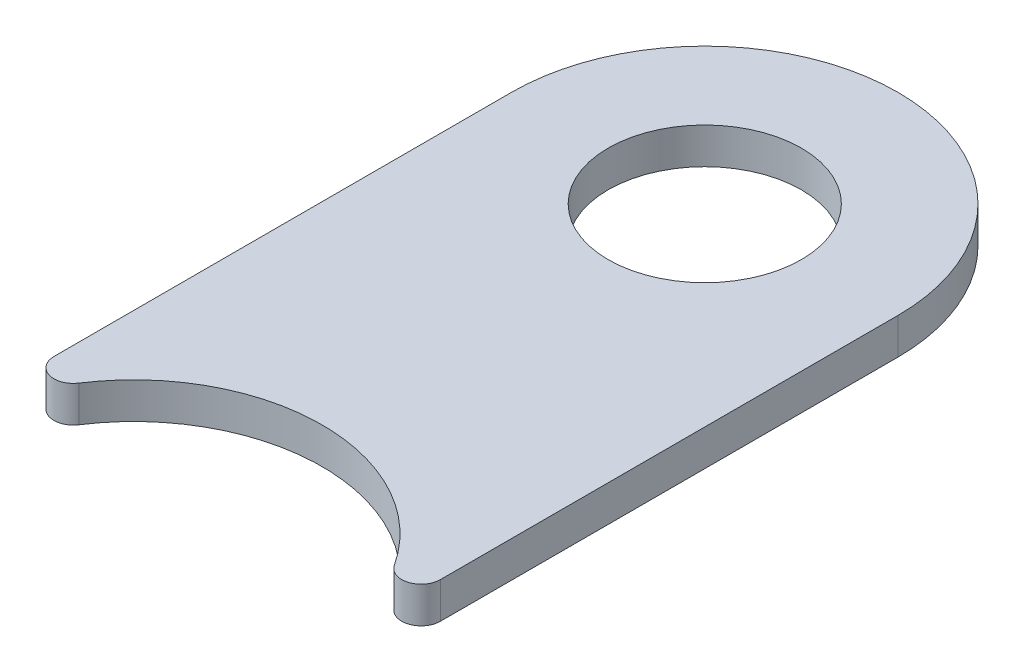
ISO-10303-21;
HEADER;
FILE_DESCRIPTION(('STEP AP214'),'2;1');
FILE_NAME('part.step','',(''),(''),'','','');
FILE_SCHEMA(('AUTOMOTIVE_DESIGN { 1 0 10303 214 1 1 1 1 }'));
ENDSEC;
DATA;
#1=APPLICATION_CONTEXT('core data for automotive mechanical design processes');
#2=APPLICATION_PROTOCOL_DEFINITION('international standard','automotive_design',2000,#1);
#3=PRODUCT_CONTEXT('',#1,'mechanical');
#4=PRODUCT('Part','Part','',(#3));
#5=PRODUCT_RELATED_PRODUCT_CATEGORY('part','',(#4));
#6=PRODUCT_DEFINITION_FORMATION('','',#4);
#7=PRODUCT_DEFINITION_CONTEXT('part definition',#1,'design');
#8=PRODUCT_DEFINITION('design','',#6,#7);
#9=PRODUCT_DEFINITION_SHAPE('','',#8);
#10=(LENGTH_UNIT() NAMED_UNIT(*) SI_UNIT(.MILLI.,.METRE.));
#11=(NAMED_UNIT(*) PLANE_ANGLE_UNIT() SI_UNIT($,.RADIAN.));
#12=(NAMED_UNIT(*) SI_UNIT($,.STERADIAN.) SOLID_ANGLE_UNIT());
#13=UNCERTAINTY_MEASURE_WITH_UNIT(LENGTH_MEASURE(1.E-05),#10,'distance_accuracy_value','');
#14=(GEOMETRIC_REPRESENTATION_CONTEXT(3) GLOBAL_UNCERTAINTY_ASSIGNED_CONTEXT((#13)) GLOBAL_UNIT_ASSIGNED_CONTEXT((#10,
#11,#12)) REPRESENTATION_CONTEXT('',''));
#15=CARTESIAN_POINT('',(0.,0.,0.));
#16=DIRECTION('',(0.,0.,1.));
#17=DIRECTION('',(1.,0.,0.));
#18=AXIS2_PLACEMENT_3D('',#15,#16,#17);
#19=CARTESIAN_POINT('',(22.86,-2.3749,-2.54));
#20=DIRECTION('',(0.,1.,0.));
#21=DIRECTION('',(0.,0.,1.));
#22=AXIS2_PLACEMENT_3D('',#19,#20,#21);
#23=CYLINDRICAL_SURFACE('',#22,2.54000000000001);
#24=CARTESIAN_POINT('',(22.86,2.3749,-2.54));
#25=DIRECTION('',(0.,1.,0.));
#26=DIRECTION('',(0.,0.,1.));
#27=AXIS2_PLACEMENT_3D('',#24,#25,#26);
#28=CIRCLE('',#27,2.54000000000001);
#29=CARTESIAN_POINT('',(20.7328946758003,2.3749,-1.15182748198889));
#30=VERTEX_POINT('',#29);
#31=CARTESIAN_POINT('',(25.4,2.3749,-2.54));
#32=VERTEX_POINT('',#31);
#33=EDGE_CURVE('E128',#30,#32,#28,.T.);
#34=ORIENTED_EDGE('',*,*,#33,.F.);
#35=DIRECTION('',(0.,1.,0.));
#36=VECTOR('',#35,1.);
#37=CARTESIAN_POINT('',(20.7328946758003,-2.3749,-1.15182748198889));
#38=LINE('',#37,#36);
#39=CARTESIAN_POINT('',(20.7328946758003,-2.3749,-1.15182748198889));
#40=VERTEX_POINT('',#39);
#41=EDGE_CURVE('E11',#40,#30,#38,.T.);
#42=ORIENTED_EDGE('',*,*,#41,.F.);
#43=CARTESIAN_POINT('',(22.86,-2.3749,-2.54));
#44=DIRECTION('',(0.,1.,0.));
#45=DIRECTION('',(0.,0.,1.));
#46=AXIS2_PLACEMENT_3D('',#43,#44,#45);
#47=CIRCLE('',#46,2.54000000000001);
#48=CARTESIAN_POINT('',(25.4,-2.3749,-2.54));
#49=VERTEX_POINT('',#48);
#50=EDGE_CURVE('E143',#40,#49,#47,.T.);
#51=ORIENTED_EDGE('',*,*,#50,.T.);
#52=DIRECTION('',(0.,1.,0.));
#53=VECTOR('',#52,1.);
#54=CARTESIAN_POINT('',(25.4,-2.3749,-2.54));
#55=LINE('',#54,#53);
#56=EDGE_CURVE('E46',#49,#32,#55,.T.);
#57=ORIENTED_EDGE('',*,*,#56,.T.);
#58=EDGE_LOOP('',(#34,#42,#51,#57));
#59=FACE_BOUND('',#58,.T.);
#60=ADVANCED_FACE('F43',(#59),#23,.T.);
#61=CARTESIAN_POINT('',(0.,-2.3749,12.3786894512019));
#62=DIRECTION('',(0.,1.,0.));
#63=DIRECTION('',(0.,0.,1.));
#64=AXIS2_PLACEMENT_3D('',#61,#62,#63);
#65=CYLINDRICAL_SURFACE('',#64,24.7573789024039);
#66=CARTESIAN_POINT('',(0.,2.3749,12.3786894512019));
#67=DIRECTION('',(0.,-1.,0.));
#68=DIRECTION('',(0.,0.,-1.));
#69=AXIS2_PLACEMENT_3D('',#66,#67,#68);
#70=CIRCLE('',#69,24.7573789024039);
#71=CARTESIAN_POINT('',(-20.7328946758003,2.3749,-1.15182748198889));
#72=VERTEX_POINT('',#71);
#73=EDGE_CURVE('E141',#72,#30,#70,.T.);
#74=ORIENTED_EDGE('',*,*,#73,.F.);
#75=DIRECTION('',(0.,1.,0.));
#76=VECTOR('',#75,1.);
#77=CARTESIAN_POINT('',(-20.7328946758003,-2.3749,-1.15182748198889));
#78=LINE('',#77,#76);
#79=CARTESIAN_POINT('',(-20.7328946758003,-2.3749,-1.15182748198889));
#80=VERTEX_POINT('',#79);
#81=EDGE_CURVE('E52',#80,#72,#78,.T.);
#82=ORIENTED_EDGE('',*,*,#81,.F.);
#83=CARTESIAN_POINT('',(0.,-2.3749,12.3786894512019));
#84=DIRECTION('',(0.,-1.,0.));
#85=DIRECTION('',(0.,0.,-1.));
#86=AXIS2_PLACEMENT_3D('',#83,#84,#85);
#87=CIRCLE('',#86,24.7573789024039);
#88=EDGE_CURVE('E118',#80,#40,#87,.T.);
#89=ORIENTED_EDGE('',*,*,#88,.T.);
#90=ORIENTED_EDGE('',*,*,#41,.T.);
#91=EDGE_LOOP('',(#74,#82,#89,#90));
#92=FACE_BOUND('',#91,.T.);
#93=ADVANCED_FACE('F151',(#92),#65,.F.);
#94=CARTESIAN_POINT('',(-22.86,-2.3749,-2.54));
#95=DIRECTION('',(0.,1.,0.));
#96=DIRECTION('',(0.,0.,1.));
#97=AXIS2_PLACEMENT_3D('',#94,#95,#96);
#98=CYLINDRICAL_SURFACE('',#97,2.54000000000001);
#99=CARTESIAN_POINT('',(-22.86,2.3749,-2.54));
#100=DIRECTION('',(0.,1.,0.));
#101=DIRECTION('',(0.,0.,-1.));
#102=AXIS2_PLACEMENT_3D('',#99,#100,#101);
#103=CIRCLE('',#102,2.54000000000001);
#104=CARTESIAN_POINT('',(-25.4,2.3749,-2.54));
#105=VERTEX_POINT('',#104);
#106=EDGE_CURVE('E105',#105,#72,#103,.T.);
#107=ORIENTED_EDGE('',*,*,#106,.F.);
#108=DIRECTION('',(0.,1.,0.));
#109=VECTOR('',#108,1.);
#110=CARTESIAN_POINT('',(-25.4,-2.3749,-2.54));
#111=LINE('',#110,#109);
#112=CARTESIAN_POINT('',(-25.4,-2.3749,-2.54));
#113=VERTEX_POINT('',#112);
#114=EDGE_CURVE('E100',#113,#105,#111,.T.);
#115=ORIENTED_EDGE('',*,*,#114,.F.);
#116=CARTESIAN_POINT('',(-22.86,-2.3749,-2.54));
#117=DIRECTION('',(0.,1.,0.));
#118=DIRECTION('',(0.,0.,-1.));
#119=AXIS2_PLACEMENT_3D('',#116,#117,#118);
#120=CIRCLE('',#119,2.54000000000001);
#121=EDGE_CURVE('E103',#113,#80,#120,.T.);
#122=ORIENTED_EDGE('',*,*,#121,.T.);
#123=ORIENTED_EDGE('',*,*,#81,.T.);
#124=EDGE_LOOP('',(#107,#115,#122,#123));
#125=FACE_BOUND('',#124,.T.);
#126=ADVANCED_FACE('F102',(#125),#98,.T.);
#127=CARTESIAN_POINT('',(-25.4,-2.3749,-62.6872));
#128=DIRECTION('',(-1.,0.,0.));
#129=DIRECTION('',(0.,0.,1.));
#130=AXIS2_PLACEMENT_3D('',#127,#128,#129);
#131=PLANE('',#130);
#132=DIRECTION('',(0.,0.,1.));
#133=VECTOR('',#132,1.);
#134=CARTESIAN_POINT('',(-25.4,2.3749,-62.6872));
#135=LINE('',#134,#133);
#136=CARTESIAN_POINT('',(-25.4,2.3749,-62.6872));
#137=VERTEX_POINT('',#136);
#138=EDGE_CURVE('E138',#137,#105,#135,.T.);
#139=ORIENTED_EDGE('',*,*,#138,.F.);
#140=DIRECTION('',(0.,1.,0.));
#141=VECTOR('',#140,1.);
#142=CARTESIAN_POINT('',(-25.4,-2.3749,-62.6872));
#143=LINE('',#142,#141);
#144=CARTESIAN_POINT('',(-25.4,-2.3749,-62.6872));
#145=VERTEX_POINT('',#144);
#146=EDGE_CURVE('E110',#145,#137,#143,.T.);
#147=ORIENTED_EDGE('',*,*,#146,.F.);
#148=DIRECTION('',(0.,0.,1.));
#149=VECTOR('',#148,1.);
#150=CARTESIAN_POINT('',(-25.4,-2.3749,-62.6872));
#151=LINE('',#150,#149);
#152=EDGE_CURVE('E116',#145,#113,#151,.T.);
#153=ORIENTED_EDGE('',*,*,#152,.T.);
#154=ORIENTED_EDGE('',*,*,#114,.T.);
#155=EDGE_LOOP('',(#139,#147,#153,#154));
#156=FACE_BOUND('',#155,.T.);
#157=ADVANCED_FACE('F120',(#156),#131,.T.);
#158=CARTESIAN_POINT('',(0.,-2.3749,-62.6872));
#159=DIRECTION('',(0.,1.,0.));
#160=DIRECTION('',(0.,0.,1.));
#161=AXIS2_PLACEMENT_3D('',#158,#159,#160);
#162=CYLINDRICAL_SURFACE('',#161,25.4);
#163=CARTESIAN_POINT('',(0.,2.3749,-62.6872));
#164=DIRECTION('',(0.,1.,0.));
#165=DIRECTION('',(0.,0.,-1.));
#166=AXIS2_PLACEMENT_3D('',#163,#164,#165);
#167=CIRCLE('',#166,25.4);
#168=CARTESIAN_POINT('',(25.4,2.3749,-62.6872));
#169=VERTEX_POINT('',#168);
#170=EDGE_CURVE('E135',#169,#137,#167,.T.);
#171=ORIENTED_EDGE('',*,*,#170,.F.);
#172=DIRECTION('',(0.,1.,0.));
#173=VECTOR('',#172,1.);
#174=CARTESIAN_POINT('',(25.4,-2.3749,-62.6872));
#175=LINE('',#174,#173);
#176=CARTESIAN_POINT('',(25.4,-2.3749,-62.6872));
#177=VERTEX_POINT('',#176);
#178=EDGE_CURVE('E146',#177,#169,#175,.T.);
#179=ORIENTED_EDGE('',*,*,#178,.F.);
#180=CARTESIAN_POINT('',(0.,-2.3749,-62.6872));
#181=DIRECTION('',(0.,1.,0.));
#182=DIRECTION('',(0.,0.,-1.));
#183=AXIS2_PLACEMENT_3D('',#180,#181,#182);
#184=CIRCLE('',#183,25.4);
#185=EDGE_CURVE('E121',#177,#145,#184,.T.);
#186=ORIENTED_EDGE('',*,*,#185,.T.);
#187=ORIENTED_EDGE('',*,*,#146,.T.);
#188=EDGE_LOOP('',(#171,#179,#186,#187));
#189=FACE_BOUND('',#188,.T.);
#190=ADVANCED_FACE('F164',(#189),#162,.T.);
#191=CARTESIAN_POINT('',(25.4,-2.3749,-62.6872));
#192=DIRECTION('',(1.,0.,0.));
#193=DIRECTION('',(0.,0.,-1.));
#194=AXIS2_PLACEMENT_3D('',#191,#192,#193);
#195=PLANE('',#194);
#196=DIRECTION('',(0.,0.,-1.));
#197=VECTOR('',#196,1.);
#198=CARTESIAN_POINT('',(25.4,2.3749,-62.6872));
#199=LINE('',#198,#197);
#200=EDGE_CURVE('E131',#32,#169,#199,.T.);
#201=ORIENTED_EDGE('',*,*,#200,.F.);
#202=ORIENTED_EDGE('',*,*,#56,.F.);
#203=DIRECTION('',(0.,0.,-1.));
#204=VECTOR('',#203,1.);
#205=CARTESIAN_POINT('',(25.4,-2.3749,-62.6872));
#206=LINE('',#205,#204);
#207=EDGE_CURVE('E123',#49,#177,#206,.T.);
#208=ORIENTED_EDGE('',*,*,#207,.T.);
#209=ORIENTED_EDGE('',*,*,#178,.T.);
#210=EDGE_LOOP('',(#201,#202,#208,#209));
#211=FACE_BOUND('',#210,.T.);
#212=ADVANCED_FACE('F148',(#211),#195,.T.);
#213=CARTESIAN_POINT('',(22.86,-2.3749,-2.54));
#214=DIRECTION('',(0.,1.,0.));
#215=DIRECTION('',(0.,0.,1.));
#216=AXIS2_PLACEMENT_3D('',#213,#214,#215);
#217=PLANE('',#216);
#218=CARTESIAN_POINT('',(0.,-2.3749,-62.69));
#219=DIRECTION('',(0.,1.,0.));
#220=DIRECTION('',(0.,0.,-1.));
#221=AXIS2_PLACEMENT_3D('',#218,#219,#220);
#222=CIRCLE('',#221,12.7);
#223=CARTESIAN_POINT('',(0.,-2.3749,-75.39));
#224=VERTEX_POINT('',#223);
#225=EDGE_CURVE('E132',#224,#224,#222,.T.);
#226=ORIENTED_EDGE('',*,*,#225,.T.);
#227=EDGE_LOOP('',(#226));
#228=FACE_BOUND('',#227,.T.);
#229=ORIENTED_EDGE('',*,*,#50,.F.);
#230=ORIENTED_EDGE('',*,*,#88,.F.);
#231=ORIENTED_EDGE('',*,*,#121,.F.);
#232=ORIENTED_EDGE('',*,*,#152,.F.);
#233=ORIENTED_EDGE('',*,*,#185,.F.);
#234=ORIENTED_EDGE('',*,*,#207,.F.);
#235=EDGE_LOOP('',(#229,#230,#231,#232,#233,#234));
#236=FACE_BOUND('',#235,.T.);
#237=ADVANCED_FACE('F114',(#228,#236),#217,.F.);
#238=CARTESIAN_POINT('',(22.86,2.3749,-2.54));
#239=DIRECTION('',(0.,1.,0.));
#240=DIRECTION('',(0.,0.,1.));
#241=AXIS2_PLACEMENT_3D('',#238,#239,#240);
#242=PLANE('',#241);
#243=CARTESIAN_POINT('',(0.,2.3749,-62.69));
#244=DIRECTION('',(0.,1.,0.));
#245=DIRECTION('',(0.,0.,1.));
#246=AXIS2_PLACEMENT_3D('',#243,#244,#245);
#247=CIRCLE('',#246,12.7);
#248=CARTESIAN_POINT('',(0.,2.3749,-49.99));
#249=VERTEX_POINT('',#248);
#250=EDGE_CURVE('E186',#249,#249,#247,.T.);
#251=ORIENTED_EDGE('',*,*,#250,.F.);
#252=EDGE_LOOP('',(#251));
#253=FACE_BOUND('',#252,.T.);
#254=ORIENTED_EDGE('',*,*,#33,.T.);
#255=ORIENTED_EDGE('',*,*,#200,.T.);
#256=ORIENTED_EDGE('',*,*,#170,.T.);
#257=ORIENTED_EDGE('',*,*,#138,.T.);
#258=ORIENTED_EDGE('',*,*,#106,.T.);
#259=ORIENTED_EDGE('',*,*,#73,.T.);
#260=EDGE_LOOP('',(#254,#255,#256,#257,#258,#259));
#261=FACE_BOUND('',#260,.T.);
#262=ADVANCED_FACE('F150',(#253,#261),#242,.T.);
#263=CARTESIAN_POINT('',(0.,-2.3749,-62.69));
#264=DIRECTION('',(0.,1.,0.));
#265=DIRECTION('',(0.,0.,1.));
#266=AXIS2_PLACEMENT_3D('',#263,#264,#265);
#267=CYLINDRICAL_SURFACE('',#266,12.7);
#268=ORIENTED_EDGE('',*,*,#250,.T.);
#269=EDGE_LOOP('',(#268));
#270=FACE_BOUND('',#269,.T.);
#271=ORIENTED_EDGE('',*,*,#225,.F.);
#272=EDGE_LOOP('',(#271));
#273=FACE_BOUND('',#272,.T.);
#274=ADVANCED_FACE('F175',(#270,#273),#267,.F.);
#275=CLOSED_SHELL('',(#60,#93,#126,#157,#190,#212,#237,#262,#274));
#276=MANIFOLD_SOLID_BREP('B2',#275);
#277=ADVANCED_BREP_SHAPE_REPRESENTATION('',(#18,#276),#14);
#278=SHAPE_DEFINITION_REPRESENTATION(#9,#277);
ENDSEC;
END-ISO-10303-21;
